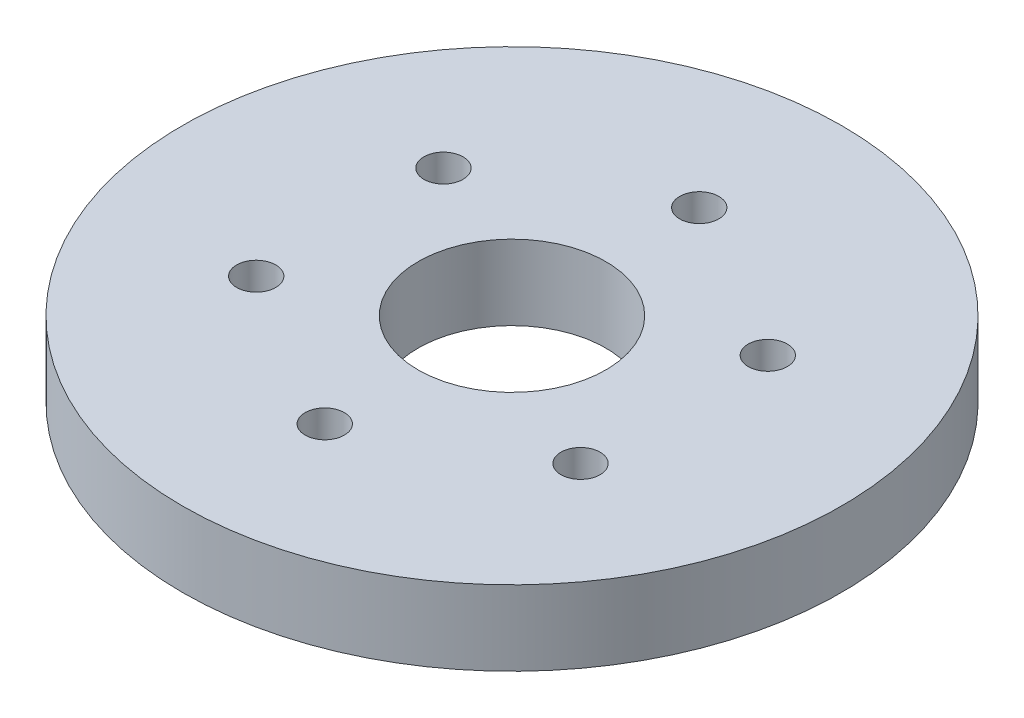
ISO-10303-21;
HEADER;
FILE_DESCRIPTION(('STEP AP214'),'2;1');
FILE_NAME('part.step','',(''),(''),'','','');
FILE_SCHEMA(('AUTOMOTIVE_DESIGN { 1 0 10303 214 1 1 1 1 }'));
ENDSEC;
DATA;
#1=APPLICATION_CONTEXT('core data for automotive mechanical design processes');
#2=APPLICATION_PROTOCOL_DEFINITION('international standard','automotive_design',2000,#1);
#3=PRODUCT_CONTEXT('',#1,'mechanical');
#4=PRODUCT('Part','Part','',(#3));
#5=PRODUCT_RELATED_PRODUCT_CATEGORY('part','',(#4));
#6=PRODUCT_DEFINITION_FORMATION('','',#4);
#7=PRODUCT_DEFINITION_CONTEXT('part definition',#1,'design');
#8=PRODUCT_DEFINITION('design','',#6,#7);
#9=PRODUCT_DEFINITION_SHAPE('','',#8);
#10=(LENGTH_UNIT() NAMED_UNIT(*) SI_UNIT(.MILLI.,.METRE.));
#11=(NAMED_UNIT(*) PLANE_ANGLE_UNIT() SI_UNIT($,.RADIAN.));
#12=(NAMED_UNIT(*) SI_UNIT($,.STERADIAN.) SOLID_ANGLE_UNIT());
#13=UNCERTAINTY_MEASURE_WITH_UNIT(LENGTH_MEASURE(1.E-05),#10,'distance_accuracy_value','');
#14=(GEOMETRIC_REPRESENTATION_CONTEXT(3) GLOBAL_UNCERTAINTY_ASSIGNED_CONTEXT((#13)) GLOBAL_UNIT_ASSIGNED_CONTEXT((#10,
#11,#12)) REPRESENTATION_CONTEXT('',''));
#15=CARTESIAN_POINT('',(0.,0.,0.));
#16=DIRECTION('',(0.,0.,1.));
#17=DIRECTION('',(1.,0.,0.));
#18=AXIS2_PLACEMENT_3D('',#15,#16,#17);
#19=CARTESIAN_POINT('',(0.,9.525,0.));
#20=DIRECTION('',(0.,-1.,0.));
#21=DIRECTION('',(0.,0.,-1.));
#22=AXIS2_PLACEMENT_3D('',#19,#20,#21);
#23=CYLINDRICAL_SURFACE('',#22,41.91);
#24=CARTESIAN_POINT('',(0.,9.525,0.));
#25=DIRECTION('',(0.,-1.,0.));
#26=DIRECTION('',(0.,0.,1.));
#27=AXIS2_PLACEMENT_3D('',#24,#25,#26);
#28=CIRCLE('',#27,41.91);
#29=CARTESIAN_POINT('',(0.,9.525,41.91));
#30=VERTEX_POINT('',#29);
#31=EDGE_CURVE('E10',#30,#30,#28,.T.);
#32=ORIENTED_EDGE('',*,*,#31,.T.);
#33=EDGE_LOOP('',(#32));
#34=FACE_BOUND('',#33,.T.);
#35=CARTESIAN_POINT('',(0.,0.,0.));
#36=DIRECTION('',(0.,-1.,0.));
#37=DIRECTION('',(0.,0.,1.));
#38=AXIS2_PLACEMENT_3D('',#35,#36,#37);
#39=CIRCLE('',#38,41.91);
#40=CARTESIAN_POINT('',(0.,0.,41.91));
#41=VERTEX_POINT('',#40);
#42=EDGE_CURVE('E40',#41,#41,#39,.T.);
#43=ORIENTED_EDGE('',*,*,#42,.F.);
#44=EDGE_LOOP('',(#43));
#45=FACE_BOUND('',#44,.T.);
#46=ADVANCED_FACE('F37',(#34,#45),#23,.T.);
#47=CARTESIAN_POINT('',(0.,9.525,0.));
#48=DIRECTION('',(0.,1.,0.));
#49=DIRECTION('',(0.,0.,1.));
#50=AXIS2_PLACEMENT_3D('',#47,#48,#49);
#51=PLANE('',#50);
#52=CARTESIAN_POINT('',(0.,9.525,-23.8125));
#53=DIRECTION('',(0.,-1.,0.));
#54=DIRECTION('',(0.,0.,1.));
#55=AXIS2_PLACEMENT_3D('',#52,#53,#54);
#56=CIRCLE('',#55,2.4892);
#57=CARTESIAN_POINT('',(0.,9.525,-21.3233));
#58=VERTEX_POINT('',#57);
#59=EDGE_CURVE('E82',#58,#58,#56,.T.);
#60=ORIENTED_EDGE('',*,*,#59,.T.);
#61=EDGE_LOOP('',(#60));
#62=FACE_BOUND('',#61,.T.);
#63=CARTESIAN_POINT('',(0.,9.525,0.));
#64=DIRECTION('',(0.,-1.,0.));
#65=DIRECTION('',(0.,0.,1.));
#66=AXIS2_PLACEMENT_3D('',#63,#64,#65);
#67=CIRCLE('',#66,11.938);
#68=CARTESIAN_POINT('',(0.,9.525,11.938));
#69=VERTEX_POINT('',#68);
#70=EDGE_CURVE('E76',#69,#69,#67,.T.);
#71=ORIENTED_EDGE('',*,*,#70,.T.);
#72=EDGE_LOOP('',(#71));
#73=FACE_BOUND('',#72,.T.);
#74=CARTESIAN_POINT('',(20.6222299276176,9.525,-11.90625));
#75=DIRECTION('',(0.,-1.,0.));
#76=DIRECTION('',(0.,0.,1.));
#77=AXIS2_PLACEMENT_3D('',#74,#75,#76);
#78=CIRCLE('',#77,2.48919999999956);
#79=CARTESIAN_POINT('',(20.6222299276176,9.525,-9.41705000000044));
#80=VERTEX_POINT('',#79);
#81=EDGE_CURVE('E70',#80,#80,#78,.T.);
#82=ORIENTED_EDGE('',*,*,#81,.T.);
#83=EDGE_LOOP('',(#82));
#84=FACE_BOUND('',#83,.T.);
#85=CARTESIAN_POINT('',(20.6222299276176,9.525,11.90625));
#86=DIRECTION('',(0.,-1.,0.));
#87=DIRECTION('',(0.,0.,1.));
#88=AXIS2_PLACEMENT_3D('',#85,#86,#87);
#89=CIRCLE('',#88,2.48920000000011);
#90=CARTESIAN_POINT('',(20.6222299276176,9.525,14.3954500000001));
#91=VERTEX_POINT('',#90);
#92=EDGE_CURVE('E64',#91,#91,#89,.T.);
#93=ORIENTED_EDGE('',*,*,#92,.T.);
#94=EDGE_LOOP('',(#93));
#95=FACE_BOUND('',#94,.T.);
#96=CARTESIAN_POINT('',(0.,9.525,23.8125));
#97=DIRECTION('',(0.,-1.,0.));
#98=DIRECTION('',(0.,0.,1.));
#99=AXIS2_PLACEMENT_3D('',#96,#97,#98);
#100=CIRCLE('',#99,2.48920000000016);
#101=CARTESIAN_POINT('',(0.,9.525,26.3017000000002));
#102=VERTEX_POINT('',#101);
#103=EDGE_CURVE('E58',#102,#102,#100,.T.);
#104=ORIENTED_EDGE('',*,*,#103,.T.);
#105=EDGE_LOOP('',(#104));
#106=FACE_BOUND('',#105,.T.);
#107=CARTESIAN_POINT('',(-20.6222299276169,9.525,11.90625));
#108=DIRECTION('',(0.,-1.,0.));
#109=DIRECTION('',(0.,0.,1.));
#110=AXIS2_PLACEMENT_3D('',#107,#108,#109);
#111=CIRCLE('',#110,2.48920000000023);
#112=CARTESIAN_POINT('',(-20.6222299276169,9.525,14.3954500000002));
#113=VERTEX_POINT('',#112);
#114=EDGE_CURVE('E52',#113,#113,#111,.T.);
#115=ORIENTED_EDGE('',*,*,#114,.T.);
#116=EDGE_LOOP('',(#115));
#117=FACE_BOUND('',#116,.T.);
#118=CARTESIAN_POINT('',(-20.6222299276169,9.525,-11.90625));
#119=DIRECTION('',(0.,-1.,0.));
#120=DIRECTION('',(0.,0.,1.));
#121=AXIS2_PLACEMENT_3D('',#118,#119,#120);
#122=CIRCLE('',#121,2.48920000000028);
#123=CARTESIAN_POINT('',(-20.6222299276169,9.525,-9.41704999999972));
#124=VERTEX_POINT('',#123);
#125=EDGE_CURVE('E47',#124,#124,#122,.T.);
#126=ORIENTED_EDGE('',*,*,#125,.T.);
#127=EDGE_LOOP('',(#126));
#128=FACE_BOUND('',#127,.T.);
#129=ORIENTED_EDGE('',*,*,#31,.F.);
#130=EDGE_LOOP('',(#129));
#131=FACE_BOUND('',#130,.T.);
#132=ADVANCED_FACE('F91',(#62,#73,#84,#95,#106,#117,#128,#131),#51,.T.);
#133=CARTESIAN_POINT('',(0.,0.,0.));
#134=DIRECTION('',(0.,1.,0.));
#135=DIRECTION('',(0.,0.,1.));
#136=AXIS2_PLACEMENT_3D('',#133,#134,#135);
#137=PLANE('',#136);
#138=CARTESIAN_POINT('',(0.,0.,-23.8125));
#139=DIRECTION('',(0.,-1.,0.));
#140=DIRECTION('',(0.,0.,1.));
#141=AXIS2_PLACEMENT_3D('',#138,#139,#140);
#142=CIRCLE('',#141,2.4892);
#143=CARTESIAN_POINT('',(0.,0.,-21.3233));
#144=VERTEX_POINT('',#143);
#145=EDGE_CURVE('E85',#144,#144,#142,.T.);
#146=ORIENTED_EDGE('',*,*,#145,.F.);
#147=EDGE_LOOP('',(#146));
#148=FACE_BOUND('',#147,.T.);
#149=CARTESIAN_POINT('',(0.,0.,0.));
#150=DIRECTION('',(0.,-1.,0.));
#151=DIRECTION('',(0.,0.,1.));
#152=AXIS2_PLACEMENT_3D('',#149,#150,#151);
#153=CIRCLE('',#152,11.938);
#154=CARTESIAN_POINT('',(0.,0.,11.938));
#155=VERTEX_POINT('',#154);
#156=EDGE_CURVE('E79',#155,#155,#153,.T.);
#157=ORIENTED_EDGE('',*,*,#156,.F.);
#158=EDGE_LOOP('',(#157));
#159=FACE_BOUND('',#158,.T.);
#160=CARTESIAN_POINT('',(20.6222299276176,0.,-11.90625));
#161=DIRECTION('',(0.,-1.,0.));
#162=DIRECTION('',(0.,0.,1.));
#163=AXIS2_PLACEMENT_3D('',#160,#161,#162);
#164=CIRCLE('',#163,2.48919999999956);
#165=CARTESIAN_POINT('',(20.6222299276176,0.,-9.41705000000044));
#166=VERTEX_POINT('',#165);
#167=EDGE_CURVE('E73',#166,#166,#164,.T.);
#168=ORIENTED_EDGE('',*,*,#167,.F.);
#169=EDGE_LOOP('',(#168));
#170=FACE_BOUND('',#169,.T.);
#171=CARTESIAN_POINT('',(20.6222299276176,0.,11.90625));
#172=DIRECTION('',(0.,-1.,0.));
#173=DIRECTION('',(0.,0.,1.));
#174=AXIS2_PLACEMENT_3D('',#171,#172,#173);
#175=CIRCLE('',#174,2.48920000000011);
#176=CARTESIAN_POINT('',(20.6222299276176,0.,14.3954500000001));
#177=VERTEX_POINT('',#176);
#178=EDGE_CURVE('E67',#177,#177,#175,.T.);
#179=ORIENTED_EDGE('',*,*,#178,.F.);
#180=EDGE_LOOP('',(#179));
#181=FACE_BOUND('',#180,.T.);
#182=CARTESIAN_POINT('',(0.,0.,23.8125));
#183=DIRECTION('',(0.,-1.,0.));
#184=DIRECTION('',(0.,0.,1.));
#185=AXIS2_PLACEMENT_3D('',#182,#183,#184);
#186=CIRCLE('',#185,2.48920000000016);
#187=CARTESIAN_POINT('',(0.,0.,26.3017000000002));
#188=VERTEX_POINT('',#187);
#189=EDGE_CURVE('E61',#188,#188,#186,.T.);
#190=ORIENTED_EDGE('',*,*,#189,.F.);
#191=EDGE_LOOP('',(#190));
#192=FACE_BOUND('',#191,.T.);
#193=CARTESIAN_POINT('',(-20.6222299276169,0.,11.90625));
#194=DIRECTION('',(0.,-1.,0.));
#195=DIRECTION('',(0.,0.,1.));
#196=AXIS2_PLACEMENT_3D('',#193,#194,#195);
#197=CIRCLE('',#196,2.48920000000023);
#198=CARTESIAN_POINT('',(-20.6222299276169,0.,14.3954500000002));
#199=VERTEX_POINT('',#198);
#200=EDGE_CURVE('E55',#199,#199,#197,.T.);
#201=ORIENTED_EDGE('',*,*,#200,.F.);
#202=EDGE_LOOP('',(#201));
#203=FACE_BOUND('',#202,.T.);
#204=CARTESIAN_POINT('',(-20.6222299276169,0.,-11.90625));
#205=DIRECTION('',(0.,-1.,0.));
#206=DIRECTION('',(0.,0.,1.));
#207=AXIS2_PLACEMENT_3D('',#204,#205,#206);
#208=CIRCLE('',#207,2.48920000000028);
#209=CARTESIAN_POINT('',(-20.6222299276169,0.,-9.41704999999972));
#210=VERTEX_POINT('',#209);
#211=EDGE_CURVE('E49',#210,#210,#208,.T.);
#212=ORIENTED_EDGE('',*,*,#211,.F.);
#213=EDGE_LOOP('',(#212));
#214=FACE_BOUND('',#213,.T.);
#215=ORIENTED_EDGE('',*,*,#42,.T.);
#216=EDGE_LOOP('',(#215));
#217=FACE_BOUND('',#216,.T.);
#218=ADVANCED_FACE('F101',(#148,#159,#170,#181,#192,#203,#214,#217),#137,.F.);
#219=CARTESIAN_POINT('',(-20.6222299276169,9.525,-11.90625));
#220=DIRECTION('',(0.,-1.,0.));
#221=DIRECTION('',(0.,0.,-1.));
#222=AXIS2_PLACEMENT_3D('',#219,#220,#221);
#223=CYLINDRICAL_SURFACE('',#222,2.48920000000028);
#224=ORIENTED_EDGE('',*,*,#125,.F.);
#225=EDGE_LOOP('',(#224));
#226=FACE_BOUND('',#225,.T.);
#227=ORIENTED_EDGE('',*,*,#211,.T.);
#228=EDGE_LOOP('',(#227));
#229=FACE_BOUND('',#228,.T.);
#230=ADVANCED_FACE('F104',(#226,#229),#223,.F.);
#231=CARTESIAN_POINT('',(-20.6222299276169,9.525,11.90625));
#232=DIRECTION('',(0.,-1.,0.));
#233=DIRECTION('',(0.,0.,-1.));
#234=AXIS2_PLACEMENT_3D('',#231,#232,#233);
#235=CYLINDRICAL_SURFACE('',#234,2.48920000000023);
#236=ORIENTED_EDGE('',*,*,#114,.F.);
#237=EDGE_LOOP('',(#236));
#238=FACE_BOUND('',#237,.T.);
#239=ORIENTED_EDGE('',*,*,#200,.T.);
#240=EDGE_LOOP('',(#239));
#241=FACE_BOUND('',#240,.T.);
#242=ADVANCED_FACE('F129',(#238,#241),#235,.F.);
#243=CARTESIAN_POINT('',(0.,9.525,23.8125));
#244=DIRECTION('',(0.,-1.,0.));
#245=DIRECTION('',(0.,0.,-1.));
#246=AXIS2_PLACEMENT_3D('',#243,#244,#245);
#247=CYLINDRICAL_SURFACE('',#246,2.48920000000016);
#248=ORIENTED_EDGE('',*,*,#103,.F.);
#249=EDGE_LOOP('',(#248));
#250=FACE_BOUND('',#249,.T.);
#251=ORIENTED_EDGE('',*,*,#189,.T.);
#252=EDGE_LOOP('',(#251));
#253=FACE_BOUND('',#252,.T.);
#254=ADVANCED_FACE('F133',(#250,#253),#247,.F.);
#255=CARTESIAN_POINT('',(20.6222299276176,9.525,11.90625));
#256=DIRECTION('',(0.,-1.,0.));
#257=DIRECTION('',(0.,0.,-1.));
#258=AXIS2_PLACEMENT_3D('',#255,#256,#257);
#259=CYLINDRICAL_SURFACE('',#258,2.48920000000011);
#260=ORIENTED_EDGE('',*,*,#92,.F.);
#261=EDGE_LOOP('',(#260));
#262=FACE_BOUND('',#261,.T.);
#263=ORIENTED_EDGE('',*,*,#178,.T.);
#264=EDGE_LOOP('',(#263));
#265=FACE_BOUND('',#264,.T.);
#266=ADVANCED_FACE('F137',(#262,#265),#259,.F.);
#267=CARTESIAN_POINT('',(20.6222299276176,9.525,-11.90625));
#268=DIRECTION('',(0.,-1.,0.));
#269=DIRECTION('',(0.,0.,-1.));
#270=AXIS2_PLACEMENT_3D('',#267,#268,#269);
#271=CYLINDRICAL_SURFACE('',#270,2.48919999999956);
#272=ORIENTED_EDGE('',*,*,#81,.F.);
#273=EDGE_LOOP('',(#272));
#274=FACE_BOUND('',#273,.T.);
#275=ORIENTED_EDGE('',*,*,#167,.T.);
#276=EDGE_LOOP('',(#275));
#277=FACE_BOUND('',#276,.T.);
#278=ADVANCED_FACE('F141',(#274,#277),#271,.F.);
#279=CARTESIAN_POINT('',(0.,9.525,0.));
#280=DIRECTION('',(0.,-1.,0.));
#281=DIRECTION('',(0.,0.,-1.));
#282=AXIS2_PLACEMENT_3D('',#279,#280,#281);
#283=CYLINDRICAL_SURFACE('',#282,11.938);
#284=ORIENTED_EDGE('',*,*,#70,.F.);
#285=EDGE_LOOP('',(#284));
#286=FACE_BOUND('',#285,.T.);
#287=ORIENTED_EDGE('',*,*,#156,.T.);
#288=EDGE_LOOP('',(#287));
#289=FACE_BOUND('',#288,.T.);
#290=ADVANCED_FACE('F97',(#286,#289),#283,.F.);
#291=CARTESIAN_POINT('',(0.,9.525,-23.8125));
#292=DIRECTION('',(0.,-1.,0.));
#293=DIRECTION('',(0.,0.,-1.));
#294=AXIS2_PLACEMENT_3D('',#291,#292,#293);
#295=CYLINDRICAL_SURFACE('',#294,2.4892);
#296=ORIENTED_EDGE('',*,*,#59,.F.);
#297=EDGE_LOOP('',(#296));
#298=FACE_BOUND('',#297,.T.);
#299=ORIENTED_EDGE('',*,*,#145,.T.);
#300=EDGE_LOOP('',(#299));
#301=FACE_BOUND('',#300,.T.);
#302=ADVANCED_FACE('F94',(#298,#301),#295,.F.);
#303=CLOSED_SHELL('',(#46,#132,#218,#230,#242,#254,#266,#278,#290,#302));
#304=MANIFOLD_SOLID_BREP('B2',#303);
#305=ADVANCED_BREP_SHAPE_REPRESENTATION('',(#18,#304),#14);
#306=SHAPE_DEFINITION_REPRESENTATION(#9,#305);
ENDSEC;
END-ISO-10303-21;
